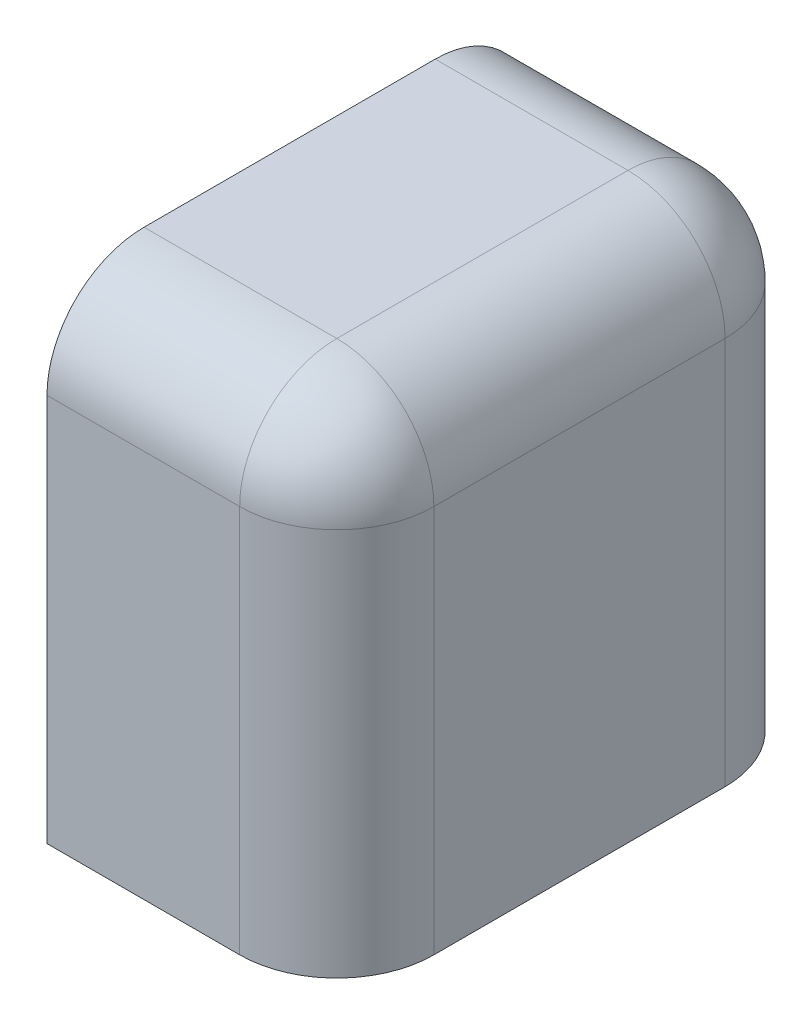
ISO-10303-21;
HEADER;
FILE_DESCRIPTION(('STEP AP214'),'2;1');
FILE_NAME('part.step','',(''),(''),'','','');
FILE_SCHEMA(('AUTOMOTIVE_DESIGN { 1 0 10303 214 1 1 1 1 }'));
ENDSEC;
DATA;
#1=APPLICATION_CONTEXT('core data for automotive mechanical design processes');
#2=APPLICATION_PROTOCOL_DEFINITION('international standard','automotive_design',2000,#1);
#3=PRODUCT_CONTEXT('',#1,'mechanical');
#4=PRODUCT('Part','Part','',(#3));
#5=PRODUCT_RELATED_PRODUCT_CATEGORY('part','',(#4));
#6=PRODUCT_DEFINITION_FORMATION('','',#4);
#7=PRODUCT_DEFINITION_CONTEXT('part definition',#1,'design');
#8=PRODUCT_DEFINITION('design','',#6,#7);
#9=PRODUCT_DEFINITION_SHAPE('','',#8);
#10=(LENGTH_UNIT() NAMED_UNIT(*) SI_UNIT(.MILLI.,.METRE.));
#11=(NAMED_UNIT(*) PLANE_ANGLE_UNIT() SI_UNIT($,.RADIAN.));
#12=(NAMED_UNIT(*) SI_UNIT($,.STERADIAN.) SOLID_ANGLE_UNIT());
#13=UNCERTAINTY_MEASURE_WITH_UNIT(LENGTH_MEASURE(1.E-05),#10,'distance_accuracy_value','');
#14=(GEOMETRIC_REPRESENTATION_CONTEXT(3) GLOBAL_UNCERTAINTY_ASSIGNED_CONTEXT((#13)) GLOBAL_UNIT_ASSIGNED_CONTEXT((#10,
#11,#12)) REPRESENTATION_CONTEXT('',''));
#15=CARTESIAN_POINT('',(0.,0.,0.));
#16=DIRECTION('',(0.,0.,1.));
#17=DIRECTION('',(1.,0.,0.));
#18=AXIS2_PLACEMENT_3D('',#15,#16,#17);
#19=CARTESIAN_POINT('',(-1.8036,0.4,0.15));
#20=DIRECTION('',(1.,0.,0.));
#21=DIRECTION('',(0.,-0.707106781186547,-0.707106781186548));
#22=AXIS2_PLACEMENT_3D('',#19,#20,#21);
#23=CYLINDRICAL_SURFACE('',#22,0.1);
#24=DIRECTION('',(1.,0.,0.));
#25=VECTOR('',#24,1.);
#26=CARTESIAN_POINT('',(0.2014,0.4,0.25));
#27=LINE('',#26,#25);
#28=CARTESIAN_POINT('',(0.2014,0.4,0.25));
#29=VERTEX_POINT('',#28);
#30=CARTESIAN_POINT('',(0.4,0.4,0.25));
#31=VERTEX_POINT('',#30);
#32=EDGE_CURVE('E11',#29,#31,#27,.T.);
#33=ORIENTED_EDGE('',*,*,#32,.T.);
#34=CARTESIAN_POINT('',(0.4,0.4,0.15));
#35=DIRECTION('',(1.,0.,0.));
#36=DIRECTION('',(0.,1.,0.));
#37=AXIS2_PLACEMENT_3D('',#34,#35,#36);
#38=CIRCLE('',#37,0.1);
#39=CARTESIAN_POINT('',(0.4,0.5,0.15));
#40=VERTEX_POINT('',#39);
#41=EDGE_CURVE('E25',#40,#31,#38,.T.);
#42=ORIENTED_EDGE('',*,*,#41,.F.);
#43=DIRECTION('',(1.,0.,0.));
#44=VECTOR('',#43,1.);
#45=CARTESIAN_POINT('',(0.2014,0.5,0.15));
#46=LINE('',#45,#44);
#47=CARTESIAN_POINT('',(0.2014,0.5,0.15));
#48=VERTEX_POINT('',#47);
#49=EDGE_CURVE('E201',#48,#40,#46,.T.);
#50=ORIENTED_EDGE('',*,*,#49,.F.);
#51=CARTESIAN_POINT('',(0.2014,0.4,0.15));
#52=DIRECTION('',(-1.,0.,0.));
#53=DIRECTION('',(0.,0.,1.));
#54=AXIS2_PLACEMENT_3D('',#51,#52,#53);
#55=CIRCLE('',#54,0.1);
#56=EDGE_CURVE('E196',#29,#48,#55,.T.);
#57=ORIENTED_EDGE('',*,*,#56,.F.);
#58=EDGE_LOOP('',(#33,#42,#50,#57));
#59=FACE_BOUND('',#58,.T.);
#60=ADVANCED_FACE('F17',(#59),#23,.T.);
#61=CARTESIAN_POINT('',(0.2014,0.,0.3514));
#62=DIRECTION('',(1.,0.,0.));
#63=DIRECTION('',(0.,0.,-1.));
#64=AXIS2_PLACEMENT_3D('',#61,#62,#63);
#65=PLANE('',#64);
#66=DIRECTION('',(0.,1.,0.));
#67=VECTOR('',#66,1.);
#68=CARTESIAN_POINT('',(0.2014,0.,-0.25));
#69=LINE('',#68,#67);
#70=CARTESIAN_POINT('',(0.2014,0.,-0.25));
#71=VERTEX_POINT('',#70);
#72=CARTESIAN_POINT('',(0.2014,0.4,-0.25));
#73=VERTEX_POINT('',#72);
#74=EDGE_CURVE('E191',#71,#73,#69,.T.);
#75=ORIENTED_EDGE('',*,*,#74,.F.);
#76=DIRECTION('',(0.,0.,-1.));
#77=VECTOR('',#76,1.);
#78=CARTESIAN_POINT('',(0.2014,0.,0.25));
#79=LINE('',#78,#77);
#80=CARTESIAN_POINT('',(0.2014,0.,0.25));
#81=VERTEX_POINT('',#80);
#82=EDGE_CURVE('E186',#81,#71,#79,.T.);
#83=ORIENTED_EDGE('',*,*,#82,.F.);
#84=DIRECTION('',(0.,1.,0.));
#85=VECTOR('',#84,1.);
#86=CARTESIAN_POINT('',(0.2014,0.,0.25));
#87=LINE('',#86,#85);
#88=EDGE_CURVE('E181',#81,#29,#87,.T.);
#89=ORIENTED_EDGE('',*,*,#88,.T.);
#90=ORIENTED_EDGE('',*,*,#56,.T.);
#91=DIRECTION('',(0.,0.,-1.));
#92=VECTOR('',#91,1.);
#93=CARTESIAN_POINT('',(0.2014,0.5,0.15));
#94=LINE('',#93,#92);
#95=CARTESIAN_POINT('',(0.2014,0.5,-0.15));
#96=VERTEX_POINT('',#95);
#97=EDGE_CURVE('E177',#48,#96,#94,.T.);
#98=ORIENTED_EDGE('',*,*,#97,.T.);
#99=CARTESIAN_POINT('',(0.2014,0.4,-0.15));
#100=DIRECTION('',(-1.,0.,0.));
#101=DIRECTION('',(0.,1.,0.));
#102=AXIS2_PLACEMENT_3D('',#99,#100,#101);
#103=CIRCLE('',#102,0.1);
#104=EDGE_CURVE('E173',#96,#73,#103,.T.);
#105=ORIENTED_EDGE('',*,*,#104,.T.);
#106=EDGE_LOOP('',(#75,#83,#89,#90,#98,#105));
#107=FACE_BOUND('',#106,.T.);
#108=ADVANCED_FACE('F229',(#107),#65,.F.);
#109=CARTESIAN_POINT('',(0.40189102071,0.4,-0.15));
#110=DIRECTION('',(-1.,0.,0.));
#111=DIRECTION('',(0.,-0.707106781186547,0.707106781186548));
#112=AXIS2_PLACEMENT_3D('',#109,#110,#111);
#113=CYLINDRICAL_SURFACE('',#112,0.1);
#114=DIRECTION('',(-1.,0.,0.));
#115=VECTOR('',#114,1.);
#116=CARTESIAN_POINT('',(0.4,0.5,-0.15));
#117=LINE('',#116,#115);
#118=CARTESIAN_POINT('',(0.4,0.5,-0.15));
#119=VERTEX_POINT('',#118);
#120=EDGE_CURVE('E168',#119,#96,#117,.T.);
#121=ORIENTED_EDGE('',*,*,#120,.F.);
#122=CARTESIAN_POINT('',(0.4,0.4,-0.15));
#123=DIRECTION('',(-1.,0.,0.));
#124=DIRECTION('',(0.,1.,0.));
#125=AXIS2_PLACEMENT_3D('',#122,#123,#124);
#126=CIRCLE('',#125,0.1);
#127=CARTESIAN_POINT('',(0.399999999999,0.4,-0.25));
#128=VERTEX_POINT('',#127);
#129=EDGE_CURVE('E111',#119,#128,#126,.T.);
#130=ORIENTED_EDGE('',*,*,#129,.T.);
#131=DIRECTION('',(-1.,0.,0.));
#132=VECTOR('',#131,1.);
#133=CARTESIAN_POINT('',(0.399999999999,0.4,-0.25));
#134=LINE('',#133,#132);
#135=EDGE_CURVE('E160',#128,#73,#134,.T.);
#136=ORIENTED_EDGE('',*,*,#135,.T.);
#137=ORIENTED_EDGE('',*,*,#104,.F.);
#138=EDGE_LOOP('',(#121,#130,#136,#137));
#139=FACE_BOUND('',#138,.T.);
#140=ADVANCED_FACE('F224',(#139),#113,.T.);
#141=CARTESIAN_POINT('',(0.5,0.,-0.25));
#142=DIRECTION('',(0.,0.,-1.));
#143=DIRECTION('',(-1.,0.,0.));
#144=AXIS2_PLACEMENT_3D('',#141,#142,#143);
#145=PLANE('',#144);
#146=DIRECTION('',(1.623423617758E-12,-1.,0.));
#147=VECTOR('',#146,1.);
#148=CARTESIAN_POINT('',(0.399999999999,0.4,-0.25));
#149=LINE('',#148,#147);
#150=CARTESIAN_POINT('',(0.4,0.,-0.25));
#151=VERTEX_POINT('',#150);
#152=EDGE_CURVE('E105',#128,#151,#149,.T.);
#153=ORIENTED_EDGE('',*,*,#152,.T.);
#154=DIRECTION('',(-1.,0.,0.));
#155=VECTOR('',#154,1.);
#156=CARTESIAN_POINT('',(0.4,0.,-0.25));
#157=LINE('',#156,#155);
#158=EDGE_CURVE('E152',#151,#71,#157,.T.);
#159=ORIENTED_EDGE('',*,*,#158,.T.);
#160=ORIENTED_EDGE('',*,*,#74,.T.);
#161=ORIENTED_EDGE('',*,*,#135,.F.);
#162=EDGE_LOOP('',(#153,#159,#160,#161));
#163=FACE_BOUND('',#162,.T.);
#164=ADVANCED_FACE('F221',(#163),#145,.T.);
#165=CARTESIAN_POINT('',(0.,0.,0.));
#166=DIRECTION('',(0.,1.,0.));
#167=DIRECTION('',(1.,0.,0.));
#168=AXIS2_PLACEMENT_3D('',#165,#166,#167);
#169=PLANE('',#168);
#170=DIRECTION('',(1.,0.,0.));
#171=VECTOR('',#170,1.);
#172=CARTESIAN_POINT('',(0.2014,0.,0.25));
#173=LINE('',#172,#171);
#174=CARTESIAN_POINT('',(0.4,0.,0.25));
#175=VERTEX_POINT('',#174);
#176=EDGE_CURVE('E147',#81,#175,#173,.T.);
#177=ORIENTED_EDGE('',*,*,#176,.F.);
#178=ORIENTED_EDGE('',*,*,#82,.T.);
#179=ORIENTED_EDGE('',*,*,#158,.F.);
#180=CARTESIAN_POINT('',(0.4,0.,-0.15));
#181=DIRECTION('',(0.,-1.,0.));
#182=DIRECTION('',(0.,0.,-1.));
#183=AXIS2_PLACEMENT_3D('',#180,#181,#182);
#184=CIRCLE('',#183,0.1);
#185=CARTESIAN_POINT('',(0.5,0.,-0.15));
#186=VERTEX_POINT('',#185);
#187=EDGE_CURVE('E143',#151,#186,#184,.T.);
#188=ORIENTED_EDGE('',*,*,#187,.T.);
#189=DIRECTION('',(0.,0.,-1.));
#190=VECTOR('',#189,1.);
#191=CARTESIAN_POINT('',(0.5,0.,0.15));
#192=LINE('',#191,#190);
#193=CARTESIAN_POINT('',(0.5,0.,0.15));
#194=VERTEX_POINT('',#193);
#195=EDGE_CURVE('E97',#194,#186,#192,.T.);
#196=ORIENTED_EDGE('',*,*,#195,.F.);
#197=CARTESIAN_POINT('',(0.4,0.,0.15));
#198=DIRECTION('',(0.,-1.,0.));
#199=DIRECTION('',(1.,0.,0.));
#200=AXIS2_PLACEMENT_3D('',#197,#198,#199);
#201=CIRCLE('',#200,0.1);
#202=EDGE_CURVE('E136',#194,#175,#201,.T.);
#203=ORIENTED_EDGE('',*,*,#202,.T.);
#204=EDGE_LOOP('',(#177,#178,#179,#188,#196,#203));
#205=FACE_BOUND('',#204,.T.);
#206=ADVANCED_FACE('F217',(#205),#169,.F.);
#207=CARTESIAN_POINT('',(0.4,1.1518,0.15));
#208=DIRECTION('',(0.,-1.,0.));
#209=DIRECTION('',(-0.707106781179476,0.,-0.707106781193619));
#210=AXIS2_PLACEMENT_3D('',#207,#208,#209);
#211=CYLINDRICAL_SURFACE('',#210,0.1);
#212=DIRECTION('',(8.57133808374E-12,-1.,0.));
#213=VECTOR('',#212,1.);
#214=CARTESIAN_POINT('',(0.399999999997,0.4,0.25));
#215=LINE('',#214,#213);
#216=EDGE_CURVE('E131',#31,#175,#215,.T.);
#217=ORIENTED_EDGE('',*,*,#216,.T.);
#218=ORIENTED_EDGE('',*,*,#202,.F.);
#219=DIRECTION('',(0.,-1.,1.623701173514E-12));
#220=VECTOR('',#219,1.);
#221=CARTESIAN_POINT('',(0.5,0.4,0.149999999999));
#222=LINE('',#221,#220);
#223=CARTESIAN_POINT('',(0.5,0.4,0.149999999999));
#224=VERTEX_POINT('',#223);
#225=EDGE_CURVE('E127',#224,#194,#222,.T.);
#226=ORIENTED_EDGE('',*,*,#225,.F.);
#227=CARTESIAN_POINT('',(0.4,0.4,0.15));
#228=DIRECTION('',(0.,1.,0.));
#229=DIRECTION('',(0.,0.,1.));
#230=AXIS2_PLACEMENT_3D('',#227,#228,#229);
#231=CIRCLE('',#230,0.1);
#232=EDGE_CURVE('E123',#31,#224,#231,.T.);
#233=ORIENTED_EDGE('',*,*,#232,.F.);
#234=EDGE_LOOP('',(#217,#218,#226,#233));
#235=FACE_BOUND('',#234,.T.);
#236=ADVANCED_FACE('F213',(#235),#211,.T.);
#237=CARTESIAN_POINT('',(0.4,0.4,0.15));
#238=DIRECTION('',(-0.707106781202048,0.,0.707106781171048));
#239=DIRECTION('',(-0.49999999998904,-0.707106781186548,-0.50000000001096));
#240=AXIS2_PLACEMENT_3D('',#237,#238,#239);
#241=SPHERICAL_SURFACE('',#240,0.1);
#242=CARTESIAN_POINT('',(0.4,0.4,0.15));
#243=DIRECTION('',(0.,0.,-1.));
#244=DIRECTION('',(0.,1.,0.));
#245=AXIS2_PLACEMENT_3D('',#242,#243,#244);
#246=CIRCLE('',#245,0.1);
#247=EDGE_CURVE('E87',#40,#224,#246,.T.);
#248=ORIENTED_EDGE('',*,*,#247,.F.);
#249=ORIENTED_EDGE('',*,*,#41,.T.);
#250=ORIENTED_EDGE('',*,*,#232,.T.);
#251=EDGE_LOOP('',(#248,#249,#250));
#252=FACE_BOUND('',#251,.T.);
#253=ADVANCED_FACE('F210',(#252),#241,.T.);
#254=CARTESIAN_POINT('',(0.4,0.4,0.15189102071));
#255=DIRECTION('',(0.,0.,-1.));
#256=DIRECTION('',(-0.707106781186548,-0.707106781186547,0.));
#257=AXIS2_PLACEMENT_3D('',#254,#255,#256);
#258=CYLINDRICAL_SURFACE('',#257,0.1);
#259=ORIENTED_EDGE('',*,*,#247,.T.);
#260=DIRECTION('',(0.,0.,-1.));
#261=VECTOR('',#260,1.);
#262=CARTESIAN_POINT('',(0.5,0.4,0.149999999999));
#263=LINE('',#262,#261);
#264=CARTESIAN_POINT('',(0.5,0.4,-0.15));
#265=VERTEX_POINT('',#264);
#266=EDGE_CURVE('E79',#224,#265,#263,.T.);
#267=ORIENTED_EDGE('',*,*,#266,.T.);
#268=CARTESIAN_POINT('',(0.4,0.4,-0.15));
#269=DIRECTION('',(0.,0.,-1.));
#270=DIRECTION('',(0.,1.,0.));
#271=AXIS2_PLACEMENT_3D('',#268,#269,#270);
#272=CIRCLE('',#271,0.1);
#273=EDGE_CURVE('E84',#119,#265,#272,.T.);
#274=ORIENTED_EDGE('',*,*,#273,.F.);
#275=DIRECTION('',(0.,0.,-1.));
#276=VECTOR('',#275,1.);
#277=CARTESIAN_POINT('',(0.4,0.5,0.15));
#278=LINE('',#277,#276);
#279=EDGE_CURVE('E108',#40,#119,#278,.T.);
#280=ORIENTED_EDGE('',*,*,#279,.F.);
#281=EDGE_LOOP('',(#259,#267,#274,#280));
#282=FACE_BOUND('',#281,.T.);
#283=ADVANCED_FACE('F81',(#282),#258,.T.);
#284=CARTESIAN_POINT('',(0.,0.5,0.));
#285=DIRECTION('',(0.,1.,0.));
#286=DIRECTION('',(1.,0.,0.));
#287=AXIS2_PLACEMENT_3D('',#284,#285,#286);
#288=PLANE('',#287);
#289=ORIENTED_EDGE('',*,*,#97,.F.);
#290=ORIENTED_EDGE('',*,*,#49,.T.);
#291=ORIENTED_EDGE('',*,*,#279,.T.);
#292=ORIENTED_EDGE('',*,*,#120,.T.);
#293=EDGE_LOOP('',(#289,#290,#291,#292));
#294=FACE_BOUND('',#293,.T.);
#295=ADVANCED_FACE('F227',(#294),#288,.T.);
#296=CARTESIAN_POINT('',(0.4,0.4,-0.15));
#297=DIRECTION('',(0.707106781171048,0.,0.707106781202048));
#298=DIRECTION('',(-0.50000000001096,-0.707106781186548,0.49999999998904));
#299=AXIS2_PLACEMENT_3D('',#296,#297,#298);
#300=SPHERICAL_SURFACE('',#299,0.1);
#301=ORIENTED_EDGE('',*,*,#129,.F.);
#302=ORIENTED_EDGE('',*,*,#273,.T.);
#303=CARTESIAN_POINT('',(0.4,0.4,-0.15));
#304=DIRECTION('',(0.,1.,0.));
#305=DIRECTION('',(1.,0.,0.));
#306=AXIS2_PLACEMENT_3D('',#303,#304,#305);
#307=CIRCLE('',#306,0.1);
#308=EDGE_CURVE('E100',#265,#128,#307,.T.);
#309=ORIENTED_EDGE('',*,*,#308,.T.);
#310=EDGE_LOOP('',(#301,#302,#309));
#311=FACE_BOUND('',#310,.T.);
#312=ADVANCED_FACE('F110',(#311),#300,.T.);
#313=CARTESIAN_POINT('',(0.4,1.1518,-0.15));
#314=DIRECTION('',(0.,-1.,0.));
#315=DIRECTION('',(-0.707106781193619,0.,0.707106781179476));
#316=AXIS2_PLACEMENT_3D('',#313,#314,#315);
#317=CYLINDRICAL_SURFACE('',#316,0.1);
#318=DIRECTION('',(0.,-1.,-8.57133808374E-12));
#319=VECTOR('',#318,1.);
#320=CARTESIAN_POINT('',(0.5,0.4,-0.149999999997));
#321=LINE('',#320,#319);
#322=EDGE_CURVE('E94',#265,#186,#321,.T.);
#323=ORIENTED_EDGE('',*,*,#322,.T.);
#324=ORIENTED_EDGE('',*,*,#187,.F.);
#325=ORIENTED_EDGE('',*,*,#152,.F.);
#326=ORIENTED_EDGE('',*,*,#308,.F.);
#327=EDGE_LOOP('',(#323,#324,#325,#326));
#328=FACE_BOUND('',#327,.T.);
#329=ADVANCED_FACE('F104',(#328),#317,.T.);
#330=CARTESIAN_POINT('',(0.5,0.,0.25));
#331=DIRECTION('',(1.,0.,0.));
#332=DIRECTION('',(0.,0.,-1.));
#333=AXIS2_PLACEMENT_3D('',#330,#331,#332);
#334=PLANE('',#333);
#335=ORIENTED_EDGE('',*,*,#225,.T.);
#336=ORIENTED_EDGE('',*,*,#195,.T.);
#337=ORIENTED_EDGE('',*,*,#322,.F.);
#338=ORIENTED_EDGE('',*,*,#266,.F.);
#339=EDGE_LOOP('',(#335,#336,#337,#338));
#340=FACE_BOUND('',#339,.T.);
#341=ADVANCED_FACE('F96',(#340),#334,.T.);
#342=CARTESIAN_POINT('',(-0.5,0.,0.25));
#343=DIRECTION('',(0.,0.,1.));
#344=DIRECTION('',(1.,0.,0.));
#345=AXIS2_PLACEMENT_3D('',#342,#343,#344);
#346=PLANE('',#345);
#347=ORIENTED_EDGE('',*,*,#88,.F.);
#348=ORIENTED_EDGE('',*,*,#176,.T.);
#349=ORIENTED_EDGE('',*,*,#216,.F.);
#350=ORIENTED_EDGE('',*,*,#32,.F.);
#351=EDGE_LOOP('',(#347,#348,#349,#350));
#352=FACE_BOUND('',#351,.T.);
#353=ADVANCED_FACE('F231',(#352),#346,.T.);
#354=CLOSED_SHELL('',(#60,#108,#140,#164,#206,#236,#253,#283,#295,#312,#329,#341,#353));
#355=MANIFOLD_SOLID_BREP('B1',#354);
#356=ADVANCED_BREP_SHAPE_REPRESENTATION('',(#18,#355),#14);
#357=SHAPE_DEFINITION_REPRESENTATION(#9,#356);
ENDSEC;
END-ISO-10303-21;
